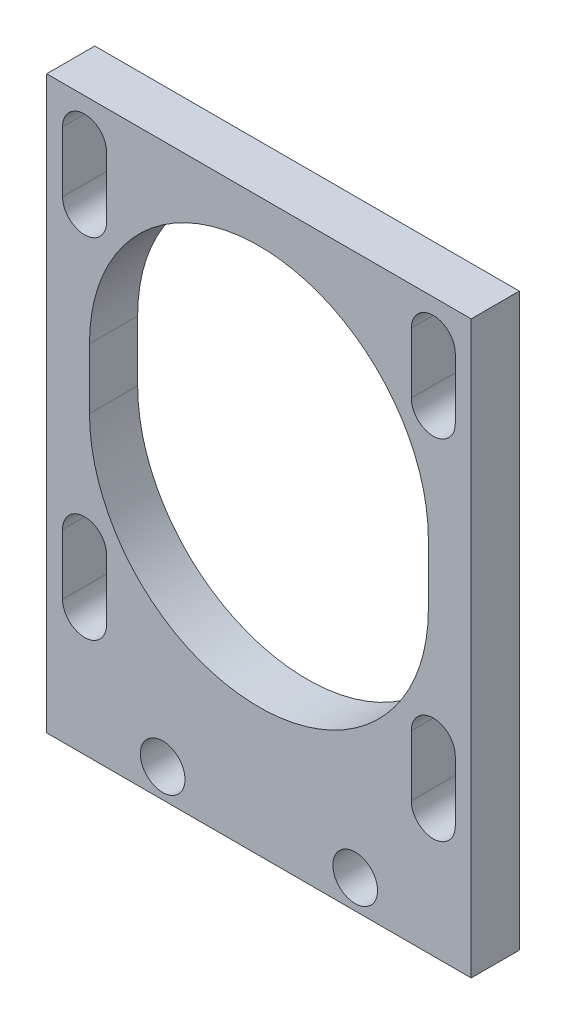
ISO-10303-21;
HEADER;
FILE_DESCRIPTION(('STEP AP214'),'2;1');
FILE_NAME('part.step','',(''),(''),'','','');
FILE_SCHEMA(('AUTOMOTIVE_DESIGN { 1 0 10303 214 1 1 1 1 }'));
ENDSEC;
DATA;
#1=APPLICATION_CONTEXT('core data for automotive mechanical design processes');
#2=APPLICATION_PROTOCOL_DEFINITION('international standard','automotive_design',2000,#1);
#3=PRODUCT_CONTEXT('',#1,'mechanical');
#4=PRODUCT('Part','Part','',(#3));
#5=PRODUCT_RELATED_PRODUCT_CATEGORY('part','',(#4));
#6=PRODUCT_DEFINITION_FORMATION('','',#4);
#7=PRODUCT_DEFINITION_CONTEXT('part definition',#1,'design');
#8=PRODUCT_DEFINITION('design','',#6,#7);
#9=PRODUCT_DEFINITION_SHAPE('','',#8);
#10=(LENGTH_UNIT() NAMED_UNIT(*) SI_UNIT(.MILLI.,.METRE.));
#11=(NAMED_UNIT(*) PLANE_ANGLE_UNIT() SI_UNIT($,.RADIAN.));
#12=(NAMED_UNIT(*) SI_UNIT($,.STERADIAN.) SOLID_ANGLE_UNIT());
#13=UNCERTAINTY_MEASURE_WITH_UNIT(LENGTH_MEASURE(1.E-05),#10,'distance_accuracy_value','');
#14=(GEOMETRIC_REPRESENTATION_CONTEXT(3) GLOBAL_UNCERTAINTY_ASSIGNED_CONTEXT((#13)) GLOBAL_UNIT_ASSIGNED_CONTEXT((#10,
#11,#12)) REPRESENTATION_CONTEXT('',''));
#15=CARTESIAN_POINT('',(0.,0.,0.));
#16=DIRECTION('',(0.,0.,1.));
#17=DIRECTION('',(1.,0.,0.));
#18=AXIS2_PLACEMENT_3D('',#15,#16,#17);
#19=CARTESIAN_POINT('',(13.99999994,-14.,3.175));
#20=DIRECTION('',(-1.,0.,0.));
#21=DIRECTION('',(0.,0.,1.));
#22=AXIS2_PLACEMENT_3D('',#19,#20,#21);
#23=PLANE('',#22);
#24=DIRECTION('',(0.,1.,0.));
#25=VECTOR('',#24,1.);
#26=CARTESIAN_POINT('',(13.99999994,-14.,3.175));
#27=LINE('',#26,#25);
#28=CARTESIAN_POINT('',(13.99999994,14.448,3.175));
#29=VERTEX_POINT('',#28);
#30=CARTESIAN_POINT('',(13.99999994,52.1,3.175));
#31=VERTEX_POINT('',#30);
#32=EDGE_CURVE('E40',#29,#31,#27,.T.);
#33=ORIENTED_EDGE('',*,*,#32,.F.);
#34=DIRECTION('',(0.,0.,-1.));
#35=VECTOR('',#34,1.);
#36=CARTESIAN_POINT('',(13.99999994,14.448,3.175));
#37=LINE('',#36,#35);
#38=CARTESIAN_POINT('',(13.99999994,14.448,0.));
#39=VERTEX_POINT('',#38);
#40=EDGE_CURVE('E195',#29,#39,#37,.T.);
#41=ORIENTED_EDGE('',*,*,#40,.T.);
#42=DIRECTION('',(0.,1.,0.));
#43=VECTOR('',#42,1.);
#44=CARTESIAN_POINT('',(13.99999994,-14.,0.));
#45=LINE('',#44,#43);
#46=CARTESIAN_POINT('',(13.99999994,52.1,0.));
#47=VERTEX_POINT('',#46);
#48=EDGE_CURVE('E230',#39,#47,#45,.T.);
#49=ORIENTED_EDGE('',*,*,#48,.T.);
#50=DIRECTION('',(0.,0.,-1.));
#51=VECTOR('',#50,1.);
#52=CARTESIAN_POINT('',(13.99999994,52.1,0.));
#53=LINE('',#52,#51);
#54=EDGE_CURVE('E213',#31,#47,#53,.T.);
#55=ORIENTED_EDGE('',*,*,#54,.F.);
#56=EDGE_LOOP('',(#33,#41,#49,#55));
#57=FACE_BOUND('',#56,.T.);
#58=ADVANCED_FACE('F32',(#57),#23,.F.);
#59=CARTESIAN_POINT('',(-13.99999994,-14.,3.175));
#60=DIRECTION('',(1.,0.,0.));
#61=DIRECTION('',(0.,0.,-1.));
#62=AXIS2_PLACEMENT_3D('',#59,#60,#61);
#63=PLANE('',#62);
#64=DIRECTION('',(0.,-1.,0.));
#65=VECTOR('',#64,1.);
#66=CARTESIAN_POINT('',(-13.99999994,-14.,0.));
#67=LINE('',#66,#65);
#68=CARTESIAN_POINT('',(-13.99999994,52.1,0.));
#69=VERTEX_POINT('',#68);
#70=CARTESIAN_POINT('',(-13.99999994,14.448,0.));
#71=VERTEX_POINT('',#70);
#72=EDGE_CURVE('E35',#69,#71,#67,.T.);
#73=ORIENTED_EDGE('',*,*,#72,.T.);
#74=DIRECTION('',(0.,0.,-1.));
#75=VECTOR('',#74,1.);
#76=CARTESIAN_POINT('',(-13.99999994,14.448,3.175));
#77=LINE('',#76,#75);
#78=CARTESIAN_POINT('',(-13.99999994,14.448,3.175));
#79=VERTEX_POINT('',#78);
#80=EDGE_CURVE('E48',#79,#71,#77,.T.);
#81=ORIENTED_EDGE('',*,*,#80,.F.);
#82=DIRECTION('',(0.,-1.,0.));
#83=VECTOR('',#82,1.);
#84=CARTESIAN_POINT('',(-13.99999994,-14.,3.175));
#85=LINE('',#84,#83);
#86=CARTESIAN_POINT('',(-13.99999994,52.1,3.175));
#87=VERTEX_POINT('',#86);
#88=EDGE_CURVE('E11',#87,#79,#85,.T.);
#89=ORIENTED_EDGE('',*,*,#88,.F.);
#90=DIRECTION('',(0.,0.,1.));
#91=VECTOR('',#90,1.);
#92=CARTESIAN_POINT('',(-13.99999994,52.1,0.));
#93=LINE('',#92,#91);
#94=EDGE_CURVE('E214',#69,#87,#93,.T.);
#95=ORIENTED_EDGE('',*,*,#94,.F.);
#96=EDGE_LOOP('',(#73,#81,#89,#95));
#97=FACE_BOUND('',#96,.T.);
#98=ADVANCED_FACE('F202',(#97),#63,.F.);
#99=CARTESIAN_POINT('',(13.99999994,14.,3.175));
#100=DIRECTION('',(0.,0.,-1.));
#101=DIRECTION('',(-1.,0.,0.));
#102=AXIS2_PLACEMENT_3D('',#99,#100,#101);
#103=PLANE('',#102);
#104=CARTESIAN_POINT('',(6.34999999999997,16.3457722435057,3.175));
#105=DIRECTION('',(0.,0.,-1.));
#106=DIRECTION('',(-1.,0.,0.));
#107=AXIS2_PLACEMENT_3D('',#104,#105,#106);
#108=CIRCLE('',#107,1.4732);
#109=CARTESIAN_POINT('',(4.87679999999998,16.3457722435057,3.175));
#110=VERTEX_POINT('',#109);
#111=EDGE_CURVE('E242',#110,#110,#108,.T.);
#112=ORIENTED_EDGE('',*,*,#111,.T.);
#113=EDGE_LOOP('',(#112));
#114=FACE_BOUND('',#113,.T.);
#115=CARTESIAN_POINT('',(-6.34999999999993,16.3457722435058,3.175));
#116=DIRECTION('',(0.,0.,-1.));
#117=DIRECTION('',(-1.,0.,0.));
#118=AXIS2_PLACEMENT_3D('',#115,#116,#117);
#119=CIRCLE('',#118,1.4732);
#120=CARTESIAN_POINT('',(-7.82319999999993,16.3457722435058,3.175));
#121=VERTEX_POINT('',#120);
#122=EDGE_CURVE('E248',#121,#121,#119,.T.);
#123=ORIENTED_EDGE('',*,*,#122,.T.);
#124=EDGE_LOOP('',(#123));
#125=FACE_BOUND('',#124,.T.);
#126=DIRECTION('',(0.,-1.,0.));
#127=VECTOR('',#126,1.);
#128=CARTESIAN_POINT('',(11.176,34.1,3.175));
#129=LINE('',#128,#127);
#130=CARTESIAN_POINT('',(11.176,38.1,3.175));
#131=VERTEX_POINT('',#130);
#132=CARTESIAN_POINT('',(11.176,34.1,3.175));
#133=VERTEX_POINT('',#132);
#134=EDGE_CURVE('E260',#131,#133,#129,.T.);
#135=ORIENTED_EDGE('',*,*,#134,.T.);
#136=CARTESIAN_POINT('',(0.,34.1,3.175));
#137=DIRECTION('',(0.,0.,-1.));
#138=DIRECTION('',(-1.,0.,0.));
#139=AXIS2_PLACEMENT_3D('',#136,#137,#138);
#140=CIRCLE('',#139,11.176);
#141=CARTESIAN_POINT('',(-11.176,34.1,3.175));
#142=VERTEX_POINT('',#141);
#143=EDGE_CURVE('E252',#133,#142,#140,.T.);
#144=ORIENTED_EDGE('',*,*,#143,.T.);
#145=DIRECTION('',(0.,1.,0.));
#146=VECTOR('',#145,1.);
#147=CARTESIAN_POINT('',(-11.176,34.1,3.175));
#148=LINE('',#147,#146);
#149=CARTESIAN_POINT('',(-11.176,38.1,3.175));
#150=VERTEX_POINT('',#149);
#151=EDGE_CURVE('E255',#142,#150,#148,.T.);
#152=ORIENTED_EDGE('',*,*,#151,.T.);
#153=CARTESIAN_POINT('',(0.,38.1,3.175));
#154=DIRECTION('',(0.,0.,-1.));
#155=DIRECTION('',(-1.,0.,0.));
#156=AXIS2_PLACEMENT_3D('',#153,#154,#155);
#157=CIRCLE('',#156,11.176);
#158=EDGE_CURVE('E56',#150,#131,#157,.T.);
#159=ORIENTED_EDGE('',*,*,#158,.T.);
#160=EDGE_LOOP('',(#135,#144,#152,#159));
#161=FACE_BOUND('',#160,.T.);
#162=DIRECTION('',(0.,-1.,0.));
#163=VECTOR('',#162,1.);
#164=CARTESIAN_POINT('',(-10.05000006,22.6,3.175));
#165=LINE('',#164,#163);
#166=CARTESIAN_POINT('',(-10.05000006,26.6,3.175));
#167=VERTEX_POINT('',#166);
#168=CARTESIAN_POINT('',(-10.05000006,22.6,3.175));
#169=VERTEX_POINT('',#168);
#170=EDGE_CURVE('E292',#167,#169,#165,.T.);
#171=ORIENTED_EDGE('',*,*,#170,.T.);
#172=CARTESIAN_POINT('',(-11.50000006,22.6,3.175));
#173=DIRECTION('',(0.,0.,-1.));
#174=DIRECTION('',(-1.,0.,0.));
#175=AXIS2_PLACEMENT_3D('',#172,#173,#174);
#176=CIRCLE('',#175,1.45);
#177=CARTESIAN_POINT('',(-12.95000006,22.6,3.175));
#178=VERTEX_POINT('',#177);
#179=EDGE_CURVE('E282',#169,#178,#176,.T.);
#180=ORIENTED_EDGE('',*,*,#179,.T.);
#181=DIRECTION('',(0.,1.,0.));
#182=VECTOR('',#181,1.);
#183=CARTESIAN_POINT('',(-12.95000006,22.6,3.175));
#184=LINE('',#183,#182);
#185=CARTESIAN_POINT('',(-12.95000006,26.6,3.175));
#186=VERTEX_POINT('',#185);
#187=EDGE_CURVE('E285',#178,#186,#184,.T.);
#188=ORIENTED_EDGE('',*,*,#187,.T.);
#189=CARTESIAN_POINT('',(-11.5000000600002,26.6,3.175));
#190=DIRECTION('',(0.,0.,-1.));
#191=DIRECTION('',(-1.,0.,0.));
#192=AXIS2_PLACEMENT_3D('',#189,#190,#191);
#193=CIRCLE('',#192,1.45);
#194=EDGE_CURVE('E289',#186,#167,#193,.T.);
#195=ORIENTED_EDGE('',*,*,#194,.T.);
#196=EDGE_LOOP('',(#171,#180,#188,#195));
#197=FACE_BOUND('',#196,.T.);
#198=DIRECTION('',(0.,-1.,0.));
#199=VECTOR('',#198,1.);
#200=CARTESIAN_POINT('',(12.94999994,22.6,3.175));
#201=LINE('',#200,#199);
#202=CARTESIAN_POINT('',(12.94999994,26.6,3.175));
#203=VERTEX_POINT('',#202);
#204=CARTESIAN_POINT('',(12.94999994,22.6,3.175));
#205=VERTEX_POINT('',#204);
#206=EDGE_CURVE('E324',#203,#205,#201,.T.);
#207=ORIENTED_EDGE('',*,*,#206,.T.);
#208=CARTESIAN_POINT('',(11.49999994,22.6,3.175));
#209=DIRECTION('',(0.,0.,-1.));
#210=DIRECTION('',(-1.,0.,0.));
#211=AXIS2_PLACEMENT_3D('',#208,#209,#210);
#212=CIRCLE('',#211,1.45);
#213=CARTESIAN_POINT('',(10.04999994,22.6,3.175));
#214=VERTEX_POINT('',#213);
#215=EDGE_CURVE('E314',#205,#214,#212,.T.);
#216=ORIENTED_EDGE('',*,*,#215,.T.);
#217=DIRECTION('',(0.,1.,0.));
#218=VECTOR('',#217,1.);
#219=CARTESIAN_POINT('',(10.04999994,22.6,3.175));
#220=LINE('',#219,#218);
#221=CARTESIAN_POINT('',(10.04999994,26.6,3.175));
#222=VERTEX_POINT('',#221);
#223=EDGE_CURVE('E317',#214,#222,#220,.T.);
#224=ORIENTED_EDGE('',*,*,#223,.T.);
#225=CARTESIAN_POINT('',(11.4999999399998,26.6,3.175));
#226=DIRECTION('',(0.,0.,-1.));
#227=DIRECTION('',(-1.,0.,0.));
#228=AXIS2_PLACEMENT_3D('',#225,#226,#227);
#229=CIRCLE('',#228,1.45);
#230=EDGE_CURVE('E321',#222,#203,#229,.T.);
#231=ORIENTED_EDGE('',*,*,#230,.T.);
#232=EDGE_LOOP('',(#207,#216,#224,#231));
#233=FACE_BOUND('',#232,.T.);
#234=DIRECTION('',(0.,-1.,0.));
#235=VECTOR('',#234,1.);
#236=CARTESIAN_POINT('',(-10.05000006,45.6,3.175));
#237=LINE('',#236,#235);
#238=CARTESIAN_POINT('',(-10.05000006,49.6,3.175));
#239=VERTEX_POINT('',#238);
#240=CARTESIAN_POINT('',(-10.05000006,45.6,3.175));
#241=VERTEX_POINT('',#240);
#242=EDGE_CURVE('E356',#239,#241,#237,.T.);
#243=ORIENTED_EDGE('',*,*,#242,.T.);
#244=CARTESIAN_POINT('',(-11.5000000599998,45.6,3.175));
#245=DIRECTION('',(0.,0.,-1.));
#246=DIRECTION('',(-1.,0.,0.));
#247=AXIS2_PLACEMENT_3D('',#244,#245,#246);
#248=CIRCLE('',#247,1.45);
#249=CARTESIAN_POINT('',(-12.95000006,45.6,3.175));
#250=VERTEX_POINT('',#249);
#251=EDGE_CURVE('E346',#241,#250,#248,.T.);
#252=ORIENTED_EDGE('',*,*,#251,.T.);
#253=DIRECTION('',(0.,1.,0.));
#254=VECTOR('',#253,1.);
#255=CARTESIAN_POINT('',(-12.95000006,45.6,3.175));
#256=LINE('',#255,#254);
#257=CARTESIAN_POINT('',(-12.95000006,49.6,3.175));
#258=VERTEX_POINT('',#257);
#259=EDGE_CURVE('E349',#250,#258,#256,.T.);
#260=ORIENTED_EDGE('',*,*,#259,.T.);
#261=CARTESIAN_POINT('',(-11.50000006,49.6,3.175));
#262=DIRECTION('',(0.,0.,-1.));
#263=DIRECTION('',(-1.,0.,0.));
#264=AXIS2_PLACEMENT_3D('',#261,#262,#263);
#265=CIRCLE('',#264,1.45);
#266=EDGE_CURVE('E353',#258,#239,#265,.T.);
#267=ORIENTED_EDGE('',*,*,#266,.T.);
#268=EDGE_LOOP('',(#243,#252,#260,#267));
#269=FACE_BOUND('',#268,.T.);
#270=DIRECTION('',(0.,-1.,0.));
#271=VECTOR('',#270,1.);
#272=CARTESIAN_POINT('',(12.94999994,45.6,3.175));
#273=LINE('',#272,#271);
#274=CARTESIAN_POINT('',(12.94999994,49.6,3.175));
#275=VERTEX_POINT('',#274);
#276=CARTESIAN_POINT('',(12.94999994,45.6,3.175));
#277=VERTEX_POINT('',#276);
#278=EDGE_CURVE('E388',#275,#277,#273,.T.);
#279=ORIENTED_EDGE('',*,*,#278,.T.);
#280=CARTESIAN_POINT('',(11.49999994,45.6,3.175));
#281=DIRECTION('',(0.,0.,-1.));
#282=DIRECTION('',(-1.,0.,0.));
#283=AXIS2_PLACEMENT_3D('',#280,#281,#282);
#284=CIRCLE('',#283,1.45);
#285=CARTESIAN_POINT('',(10.04999994,45.6,3.175));
#286=VERTEX_POINT('',#285);
#287=EDGE_CURVE('E378',#277,#286,#284,.T.);
#288=ORIENTED_EDGE('',*,*,#287,.T.);
#289=DIRECTION('',(0.,1.,0.));
#290=VECTOR('',#289,1.);
#291=CARTESIAN_POINT('',(10.04999994,45.6,3.175));
#292=LINE('',#291,#290);
#293=CARTESIAN_POINT('',(10.04999994,49.6,3.175));
#294=VERTEX_POINT('',#293);
#295=EDGE_CURVE('E381',#286,#294,#292,.T.);
#296=ORIENTED_EDGE('',*,*,#295,.T.);
#297=CARTESIAN_POINT('',(11.49999994,49.6,3.175));
#298=DIRECTION('',(0.,0.,-1.));
#299=DIRECTION('',(-1.,0.,0.));
#300=AXIS2_PLACEMENT_3D('',#297,#298,#299);
#301=CIRCLE('',#300,1.45);
#302=EDGE_CURVE('E385',#294,#275,#301,.T.);
#303=ORIENTED_EDGE('',*,*,#302,.T.);
#304=EDGE_LOOP('',(#279,#288,#296,#303));
#305=FACE_BOUND('',#304,.T.);
#306=ORIENTED_EDGE('',*,*,#88,.T.);
#307=DIRECTION('',(1.,0.,0.));
#308=VECTOR('',#307,1.);
#309=CARTESIAN_POINT('',(13.99999994,14.448,3.175));
#310=LINE('',#309,#308);
#311=EDGE_CURVE('E192',#79,#29,#310,.T.);
#312=ORIENTED_EDGE('',*,*,#311,.T.);
#313=ORIENTED_EDGE('',*,*,#32,.T.);
#314=DIRECTION('',(1.,0.,0.));
#315=VECTOR('',#314,1.);
#316=CARTESIAN_POINT('',(-13.99999994,52.1,3.175));
#317=LINE('',#316,#315);
#318=EDGE_CURVE('E208',#87,#31,#317,.T.);
#319=ORIENTED_EDGE('',*,*,#318,.F.);
#320=EDGE_LOOP('',(#306,#312,#313,#319));
#321=FACE_BOUND('',#320,.T.);
#322=ADVANCED_FACE('F206',(#114,#125,#161,#197,#233,#269,#305,#321),#103,.F.);
#323=CARTESIAN_POINT('',(13.99999994,14.,0.));
#324=DIRECTION('',(0.,0.,-1.));
#325=DIRECTION('',(-1.,0.,0.));
#326=AXIS2_PLACEMENT_3D('',#323,#324,#325);
#327=PLANE('',#326);
#328=DIRECTION('',(1.,0.,0.));
#329=VECTOR('',#328,1.);
#330=CARTESIAN_POINT('',(13.99999994,14.448,0.));
#331=LINE('',#330,#329);
#332=EDGE_CURVE('E198',#71,#39,#331,.T.);
#333=ORIENTED_EDGE('',*,*,#332,.F.);
#334=ORIENTED_EDGE('',*,*,#72,.F.);
#335=DIRECTION('',(-1.,0.,0.));
#336=VECTOR('',#335,1.);
#337=CARTESIAN_POINT('',(-13.99999994,52.1,0.));
#338=LINE('',#337,#336);
#339=EDGE_CURVE('E219',#47,#69,#338,.T.);
#340=ORIENTED_EDGE('',*,*,#339,.F.);
#341=ORIENTED_EDGE('',*,*,#48,.F.);
#342=EDGE_LOOP('',(#333,#334,#340,#341));
#343=FACE_BOUND('',#342,.T.);
#344=CARTESIAN_POINT('',(6.34999999999997,16.3457722435057,0.));
#345=DIRECTION('',(0.,0.,-1.));
#346=DIRECTION('',(-1.,0.,0.));
#347=AXIS2_PLACEMENT_3D('',#344,#345,#346);
#348=CIRCLE('',#347,1.4732);
#349=CARTESIAN_POINT('',(4.87679999999998,16.3457722435057,0.));
#350=VERTEX_POINT('',#349);
#351=EDGE_CURVE('E238',#350,#350,#348,.T.);
#352=ORIENTED_EDGE('',*,*,#351,.F.);
#353=EDGE_LOOP('',(#352));
#354=FACE_BOUND('',#353,.T.);
#355=CARTESIAN_POINT('',(-6.34999999999993,16.3457722435058,0.));
#356=DIRECTION('',(0.,0.,-1.));
#357=DIRECTION('',(-1.,0.,0.));
#358=AXIS2_PLACEMENT_3D('',#355,#356,#357);
#359=CIRCLE('',#358,1.4732);
#360=CARTESIAN_POINT('',(-7.82319999999993,16.3457722435058,0.));
#361=VERTEX_POINT('',#360);
#362=EDGE_CURVE('E245',#361,#361,#359,.T.);
#363=ORIENTED_EDGE('',*,*,#362,.F.);
#364=EDGE_LOOP('',(#363));
#365=FACE_BOUND('',#364,.T.);
#366=CARTESIAN_POINT('',(0.,34.1,0.));
#367=DIRECTION('',(0.,0.,-1.));
#368=DIRECTION('',(-1.,0.,0.));
#369=AXIS2_PLACEMENT_3D('',#366,#367,#368);
#370=CIRCLE('',#369,11.176);
#371=CARTESIAN_POINT('',(11.176,34.1,0.));
#372=VERTEX_POINT('',#371);
#373=CARTESIAN_POINT('',(-11.176,34.1,0.));
#374=VERTEX_POINT('',#373);
#375=EDGE_CURVE('E251',#372,#374,#370,.T.);
#376=ORIENTED_EDGE('',*,*,#375,.F.);
#377=DIRECTION('',(0.,-1.,0.));
#378=VECTOR('',#377,1.);
#379=CARTESIAN_POINT('',(11.176,34.1,0.));
#380=LINE('',#379,#378);
#381=CARTESIAN_POINT('',(11.176,38.1,0.));
#382=VERTEX_POINT('',#381);
#383=EDGE_CURVE('E256',#382,#372,#380,.T.);
#384=ORIENTED_EDGE('',*,*,#383,.F.);
#385=CARTESIAN_POINT('',(0.,38.1,0.));
#386=DIRECTION('',(0.,0.,-1.));
#387=DIRECTION('',(-1.,0.,0.));
#388=AXIS2_PLACEMENT_3D('',#385,#386,#387);
#389=CIRCLE('',#388,11.176);
#390=CARTESIAN_POINT('',(-11.176,38.1,0.));
#391=VERTEX_POINT('',#390);
#392=EDGE_CURVE('E268',#391,#382,#389,.T.);
#393=ORIENTED_EDGE('',*,*,#392,.F.);
#394=DIRECTION('',(0.,1.,0.));
#395=VECTOR('',#394,1.);
#396=CARTESIAN_POINT('',(-11.176,34.1,0.));
#397=LINE('',#396,#395);
#398=EDGE_CURVE('E265',#374,#391,#397,.T.);
#399=ORIENTED_EDGE('',*,*,#398,.F.);
#400=EDGE_LOOP('',(#376,#384,#393,#399));
#401=FACE_BOUND('',#400,.T.);
#402=CARTESIAN_POINT('',(-11.50000006,22.6,0.));
#403=DIRECTION('',(0.,0.,-1.));
#404=DIRECTION('',(-1.,0.,0.));
#405=AXIS2_PLACEMENT_3D('',#402,#403,#404);
#406=CIRCLE('',#405,1.45);
#407=CARTESIAN_POINT('',(-10.05000006,22.6,0.));
#408=VERTEX_POINT('',#407);
#409=CARTESIAN_POINT('',(-12.95000006,22.6,0.));
#410=VERTEX_POINT('',#409);
#411=EDGE_CURVE('E275',#408,#410,#406,.T.);
#412=ORIENTED_EDGE('',*,*,#411,.F.);
#413=DIRECTION('',(0.,-1.,0.));
#414=VECTOR('',#413,1.);
#415=CARTESIAN_POINT('',(-10.05000006,22.6,0.));
#416=LINE('',#415,#414);
#417=CARTESIAN_POINT('',(-10.05000006,26.6,0.));
#418=VERTEX_POINT('',#417);
#419=EDGE_CURVE('E286',#418,#408,#416,.T.);
#420=ORIENTED_EDGE('',*,*,#419,.F.);
#421=CARTESIAN_POINT('',(-11.5000000600002,26.6,0.));
#422=DIRECTION('',(0.,0.,-1.));
#423=DIRECTION('',(-1.,0.,0.));
#424=AXIS2_PLACEMENT_3D('',#421,#422,#423);
#425=CIRCLE('',#424,1.45);
#426=CARTESIAN_POINT('',(-12.9500000600002,26.6,0.));
#427=VERTEX_POINT('',#426);
#428=EDGE_CURVE('E300',#427,#418,#425,.T.);
#429=ORIENTED_EDGE('',*,*,#428,.F.);
#430=DIRECTION('',(0.,1.,0.));
#431=VECTOR('',#430,1.);
#432=CARTESIAN_POINT('',(-12.95000006,22.6,0.));
#433=LINE('',#432,#431);
#434=EDGE_CURVE('E297',#410,#427,#433,.T.);
#435=ORIENTED_EDGE('',*,*,#434,.F.);
#436=EDGE_LOOP('',(#412,#420,#429,#435));
#437=FACE_BOUND('',#436,.T.);
#438=CARTESIAN_POINT('',(11.49999994,22.6,0.));
#439=DIRECTION('',(0.,0.,-1.));
#440=DIRECTION('',(-1.,0.,0.));
#441=AXIS2_PLACEMENT_3D('',#438,#439,#440);
#442=CIRCLE('',#441,1.45);
#443=CARTESIAN_POINT('',(12.94999994,22.6,0.));
#444=VERTEX_POINT('',#443);
#445=CARTESIAN_POINT('',(10.04999994,22.6,0.));
#446=VERTEX_POINT('',#445);
#447=EDGE_CURVE('E307',#444,#446,#442,.T.);
#448=ORIENTED_EDGE('',*,*,#447,.F.);
#449=DIRECTION('',(0.,-1.,0.));
#450=VECTOR('',#449,1.);
#451=CARTESIAN_POINT('',(12.94999994,22.6,0.));
#452=LINE('',#451,#450);
#453=CARTESIAN_POINT('',(12.94999994,26.6,0.));
#454=VERTEX_POINT('',#453);
#455=EDGE_CURVE('E318',#454,#444,#452,.T.);
#456=ORIENTED_EDGE('',*,*,#455,.F.);
#457=CARTESIAN_POINT('',(11.4999999399998,26.6,0.));
#458=DIRECTION('',(0.,0.,-1.));
#459=DIRECTION('',(-1.,0.,0.));
#460=AXIS2_PLACEMENT_3D('',#457,#458,#459);
#461=CIRCLE('',#460,1.45);
#462=CARTESIAN_POINT('',(10.0499999399998,26.6,0.));
#463=VERTEX_POINT('',#462);
#464=EDGE_CURVE('E332',#463,#454,#461,.T.);
#465=ORIENTED_EDGE('',*,*,#464,.F.);
#466=DIRECTION('',(0.,1.,0.));
#467=VECTOR('',#466,1.);
#468=CARTESIAN_POINT('',(10.04999994,22.6,0.));
#469=LINE('',#468,#467);
#470=EDGE_CURVE('E329',#446,#463,#469,.T.);
#471=ORIENTED_EDGE('',*,*,#470,.F.);
#472=EDGE_LOOP('',(#448,#456,#465,#471));
#473=FACE_BOUND('',#472,.T.);
#474=CARTESIAN_POINT('',(-11.5000000599998,45.6,0.));
#475=DIRECTION('',(0.,0.,-1.));
#476=DIRECTION('',(-1.,0.,0.));
#477=AXIS2_PLACEMENT_3D('',#474,#475,#476);
#478=CIRCLE('',#477,1.45);
#479=CARTESIAN_POINT('',(-10.05000006,45.6,0.));
#480=VERTEX_POINT('',#479);
#481=CARTESIAN_POINT('',(-12.95000006,45.6,0.));
#482=VERTEX_POINT('',#481);
#483=EDGE_CURVE('E339',#480,#482,#478,.T.);
#484=ORIENTED_EDGE('',*,*,#483,.F.);
#485=DIRECTION('',(0.,-1.,0.));
#486=VECTOR('',#485,1.);
#487=CARTESIAN_POINT('',(-10.05000006,45.6,0.));
#488=LINE('',#487,#486);
#489=CARTESIAN_POINT('',(-10.05000006,49.6,0.));
#490=VERTEX_POINT('',#489);
#491=EDGE_CURVE('E350',#490,#480,#488,.T.);
#492=ORIENTED_EDGE('',*,*,#491,.F.);
#493=CARTESIAN_POINT('',(-11.50000006,49.6,0.));
#494=DIRECTION('',(0.,0.,-1.));
#495=DIRECTION('',(-1.,0.,0.));
#496=AXIS2_PLACEMENT_3D('',#493,#494,#495);
#497=CIRCLE('',#496,1.45);
#498=CARTESIAN_POINT('',(-12.95000006,49.6,0.));
#499=VERTEX_POINT('',#498);
#500=EDGE_CURVE('E364',#499,#490,#497,.T.);
#501=ORIENTED_EDGE('',*,*,#500,.F.);
#502=DIRECTION('',(0.,1.,0.));
#503=VECTOR('',#502,1.);
#504=CARTESIAN_POINT('',(-12.95000006,45.6,0.));
#505=LINE('',#504,#503);
#506=EDGE_CURVE('E361',#482,#499,#505,.T.);
#507=ORIENTED_EDGE('',*,*,#506,.F.);
#508=EDGE_LOOP('',(#484,#492,#501,#507));
#509=FACE_BOUND('',#508,.T.);
#510=CARTESIAN_POINT('',(11.49999994,45.6,0.));
#511=DIRECTION('',(0.,0.,-1.));
#512=DIRECTION('',(-1.,0.,0.));
#513=AXIS2_PLACEMENT_3D('',#510,#511,#512);
#514=CIRCLE('',#513,1.45);
#515=CARTESIAN_POINT('',(12.94999994,45.6,0.));
#516=VERTEX_POINT('',#515);
#517=CARTESIAN_POINT('',(10.04999994,45.6,0.));
#518=VERTEX_POINT('',#517);
#519=EDGE_CURVE('E371',#516,#518,#514,.T.);
#520=ORIENTED_EDGE('',*,*,#519,.F.);
#521=DIRECTION('',(0.,-1.,0.));
#522=VECTOR('',#521,1.);
#523=CARTESIAN_POINT('',(12.94999994,45.6,0.));
#524=LINE('',#523,#522);
#525=CARTESIAN_POINT('',(12.94999994,49.6,0.));
#526=VERTEX_POINT('',#525);
#527=EDGE_CURVE('E382',#526,#516,#524,.T.);
#528=ORIENTED_EDGE('',*,*,#527,.F.);
#529=CARTESIAN_POINT('',(11.49999994,49.6,0.));
#530=DIRECTION('',(0.,0.,-1.));
#531=DIRECTION('',(-1.,0.,0.));
#532=AXIS2_PLACEMENT_3D('',#529,#530,#531);
#533=CIRCLE('',#532,1.45);
#534=CARTESIAN_POINT('',(10.04999994,49.6,0.));
#535=VERTEX_POINT('',#534);
#536=EDGE_CURVE('E395',#535,#526,#533,.T.);
#537=ORIENTED_EDGE('',*,*,#536,.F.);
#538=DIRECTION('',(0.,1.,0.));
#539=VECTOR('',#538,1.);
#540=CARTESIAN_POINT('',(10.04999994,45.6,0.));
#541=LINE('',#540,#539);
#542=EDGE_CURVE('E392',#518,#535,#541,.T.);
#543=ORIENTED_EDGE('',*,*,#542,.F.);
#544=EDGE_LOOP('',(#520,#528,#537,#543));
#545=FACE_BOUND('',#544,.T.);
#546=ADVANCED_FACE('F234',(#343,#354,#365,#401,#437,#473,#509,#545),#327,.T.);
#547=CARTESIAN_POINT('',(-13.99999994,52.1,3.175));
#548=DIRECTION('',(0.,1.,0.));
#549=DIRECTION('',(0.,0.,1.));
#550=AXIS2_PLACEMENT_3D('',#547,#548,#549);
#551=PLANE('',#550);
#552=ORIENTED_EDGE('',*,*,#94,.T.);
#553=ORIENTED_EDGE('',*,*,#318,.T.);
#554=ORIENTED_EDGE('',*,*,#54,.T.);
#555=ORIENTED_EDGE('',*,*,#339,.T.);
#556=EDGE_LOOP('',(#552,#553,#554,#555));
#557=FACE_BOUND('',#556,.T.);
#558=ADVANCED_FACE('F217',(#557),#551,.T.);
#559=CARTESIAN_POINT('',(11.49999994,45.6,3.175));
#560=DIRECTION('',(0.,0.,-1.));
#561=DIRECTION('',(-1.,0.,0.));
#562=AXIS2_PLACEMENT_3D('',#559,#560,#561);
#563=CYLINDRICAL_SURFACE('',#562,1.45);
#564=ORIENTED_EDGE('',*,*,#519,.T.);
#565=DIRECTION('',(0.,0.,-1.));
#566=VECTOR('',#565,1.);
#567=CARTESIAN_POINT('',(10.04999994,45.6,3.175));
#568=LINE('',#567,#566);
#569=EDGE_CURVE('E225',#286,#518,#568,.T.);
#570=ORIENTED_EDGE('',*,*,#569,.F.);
#571=ORIENTED_EDGE('',*,*,#287,.F.);
#572=DIRECTION('',(0.,0.,-1.));
#573=VECTOR('',#572,1.);
#574=CARTESIAN_POINT('',(12.94999994,45.6,3.175));
#575=LINE('',#574,#573);
#576=EDGE_CURVE('E220',#277,#516,#575,.T.);
#577=ORIENTED_EDGE('',*,*,#576,.T.);
#578=EDGE_LOOP('',(#564,#570,#571,#577));
#579=FACE_BOUND('',#578,.T.);
#580=ADVANCED_FACE('F419',(#579),#563,.F.);
#581=CARTESIAN_POINT('',(12.94999994,45.6,3.175));
#582=DIRECTION('',(1.,0.,0.));
#583=DIRECTION('',(0.,0.,-1.));
#584=AXIS2_PLACEMENT_3D('',#581,#582,#583);
#585=PLANE('',#584);
#586=ORIENTED_EDGE('',*,*,#527,.T.);
#587=ORIENTED_EDGE('',*,*,#576,.F.);
#588=ORIENTED_EDGE('',*,*,#278,.F.);
#589=DIRECTION('',(0.,0.,-1.));
#590=VECTOR('',#589,1.);
#591=CARTESIAN_POINT('',(12.94999994,49.6,3.175));
#592=LINE('',#591,#590);
#593=EDGE_CURVE('E222',#275,#526,#592,.T.);
#594=ORIENTED_EDGE('',*,*,#593,.T.);
#595=EDGE_LOOP('',(#586,#587,#588,#594));
#596=FACE_BOUND('',#595,.T.);
#597=ADVANCED_FACE('F417',(#596),#585,.F.);
#598=CARTESIAN_POINT('',(11.49999994,49.6,3.175));
#599=DIRECTION('',(0.,0.,-1.));
#600=DIRECTION('',(-1.,0.,0.));
#601=AXIS2_PLACEMENT_3D('',#598,#599,#600);
#602=CYLINDRICAL_SURFACE('',#601,1.45);
#603=ORIENTED_EDGE('',*,*,#536,.T.);
#604=ORIENTED_EDGE('',*,*,#593,.F.);
#605=ORIENTED_EDGE('',*,*,#302,.F.);
#606=DIRECTION('',(0.,0.,-1.));
#607=VECTOR('',#606,1.);
#608=CARTESIAN_POINT('',(10.04999994,49.6,3.175));
#609=LINE('',#608,#607);
#610=EDGE_CURVE('E400',#294,#535,#609,.T.);
#611=ORIENTED_EDGE('',*,*,#610,.T.);
#612=EDGE_LOOP('',(#603,#604,#605,#611));
#613=FACE_BOUND('',#612,.T.);
#614=ADVANCED_FACE('F414',(#613),#602,.F.);
#615=CARTESIAN_POINT('',(10.04999994,45.6,3.175));
#616=DIRECTION('',(-1.,0.,0.));
#617=DIRECTION('',(0.,0.,1.));
#618=AXIS2_PLACEMENT_3D('',#615,#616,#617);
#619=PLANE('',#618);
#620=ORIENTED_EDGE('',*,*,#542,.T.);
#621=ORIENTED_EDGE('',*,*,#610,.F.);
#622=ORIENTED_EDGE('',*,*,#295,.F.);
#623=ORIENTED_EDGE('',*,*,#569,.T.);
#624=EDGE_LOOP('',(#620,#621,#622,#623));
#625=FACE_BOUND('',#624,.T.);
#626=ADVANCED_FACE('F407',(#625),#619,.F.);
#627=CARTESIAN_POINT('',(-11.5000000599998,45.6,3.175));
#628=DIRECTION('',(0.,0.,-1.));
#629=DIRECTION('',(-1.,0.,0.));
#630=AXIS2_PLACEMENT_3D('',#627,#628,#629);
#631=CYLINDRICAL_SURFACE('',#630,1.45);
#632=ORIENTED_EDGE('',*,*,#483,.T.);
#633=DIRECTION('',(0.,0.,-1.));
#634=VECTOR('',#633,1.);
#635=CARTESIAN_POINT('',(-12.95000006,45.6,3.175));
#636=LINE('',#635,#634);
#637=EDGE_CURVE('E359',#250,#482,#636,.T.);
#638=ORIENTED_EDGE('',*,*,#637,.F.);
#639=ORIENTED_EDGE('',*,*,#251,.F.);
#640=DIRECTION('',(0.,0.,-1.));
#641=VECTOR('',#640,1.);
#642=CARTESIAN_POINT('',(-10.05000006,45.6,3.175));
#643=LINE('',#642,#641);
#644=EDGE_CURVE('E369',#241,#480,#643,.T.);
#645=ORIENTED_EDGE('',*,*,#644,.T.);
#646=EDGE_LOOP('',(#632,#638,#639,#645));
#647=FACE_BOUND('',#646,.T.);
#648=ADVANCED_FACE('F476',(#647),#631,.F.);
#649=CARTESIAN_POINT('',(-10.05000006,45.6,3.175));
#650=DIRECTION('',(1.,0.,0.));
#651=DIRECTION('',(0.,0.,-1.));
#652=AXIS2_PLACEMENT_3D('',#649,#650,#651);
#653=PLANE('',#652);
#654=ORIENTED_EDGE('',*,*,#491,.T.);
#655=ORIENTED_EDGE('',*,*,#644,.F.);
#656=ORIENTED_EDGE('',*,*,#242,.F.);
#657=DIRECTION('',(0.,0.,-1.));
#658=VECTOR('',#657,1.);
#659=CARTESIAN_POINT('',(-10.05000006,49.6,3.175));
#660=LINE('',#659,#658);
#661=EDGE_CURVE('E372',#239,#490,#660,.T.);
#662=ORIENTED_EDGE('',*,*,#661,.T.);
#663=EDGE_LOOP('',(#654,#655,#656,#662));
#664=FACE_BOUND('',#663,.T.);
#665=ADVANCED_FACE('F484',(#664),#653,.F.);
#666=CARTESIAN_POINT('',(-11.50000006,49.6,3.175));
#667=DIRECTION('',(0.,0.,-1.));
#668=DIRECTION('',(-1.,0.,0.));
#669=AXIS2_PLACEMENT_3D('',#666,#667,#668);
#670=CYLINDRICAL_SURFACE('',#669,1.45);
#671=ORIENTED_EDGE('',*,*,#500,.T.);
#672=ORIENTED_EDGE('',*,*,#661,.F.);
#673=ORIENTED_EDGE('',*,*,#266,.F.);
#674=DIRECTION('',(0.,0.,-1.));
#675=VECTOR('',#674,1.);
#676=CARTESIAN_POINT('',(-12.95000006,49.6,3.175));
#677=LINE('',#676,#675);
#678=EDGE_CURVE('E374',#258,#499,#677,.T.);
#679=ORIENTED_EDGE('',*,*,#678,.T.);
#680=EDGE_LOOP('',(#671,#672,#673,#679));
#681=FACE_BOUND('',#680,.T.);
#682=ADVANCED_FACE('F494',(#681),#670,.F.);
#683=CARTESIAN_POINT('',(-12.95000006,45.6,3.175));
#684=DIRECTION('',(-1.,0.,0.));
#685=DIRECTION('',(0.,0.,1.));
#686=AXIS2_PLACEMENT_3D('',#683,#684,#685);
#687=PLANE('',#686);
#688=ORIENTED_EDGE('',*,*,#506,.T.);
#689=ORIENTED_EDGE('',*,*,#678,.F.);
#690=ORIENTED_EDGE('',*,*,#259,.F.);
#691=ORIENTED_EDGE('',*,*,#637,.T.);
#692=EDGE_LOOP('',(#688,#689,#690,#691));
#693=FACE_BOUND('',#692,.T.);
#694=ADVANCED_FACE('F504',(#693),#687,.F.);
#695=CARTESIAN_POINT('',(11.49999994,22.6,3.175));
#696=DIRECTION('',(0.,0.,-1.));
#697=DIRECTION('',(-1.,0.,0.));
#698=AXIS2_PLACEMENT_3D('',#695,#696,#697);
#699=CYLINDRICAL_SURFACE('',#698,1.45);
#700=ORIENTED_EDGE('',*,*,#447,.T.);
#701=DIRECTION('',(0.,0.,-1.));
#702=VECTOR('',#701,1.);
#703=CARTESIAN_POINT('',(10.04999994,22.6,3.175));
#704=LINE('',#703,#702);
#705=EDGE_CURVE('E327',#214,#446,#704,.T.);
#706=ORIENTED_EDGE('',*,*,#705,.F.);
#707=ORIENTED_EDGE('',*,*,#215,.F.);
#708=DIRECTION('',(0.,0.,-1.));
#709=VECTOR('',#708,1.);
#710=CARTESIAN_POINT('',(12.94999994,22.6,3.175));
#711=LINE('',#710,#709);
#712=EDGE_CURVE('E337',#205,#444,#711,.T.);
#713=ORIENTED_EDGE('',*,*,#712,.T.);
#714=EDGE_LOOP('',(#700,#706,#707,#713));
#715=FACE_BOUND('',#714,.T.);
#716=ADVANCED_FACE('F514',(#715),#699,.F.);
#717=CARTESIAN_POINT('',(12.94999994,22.6,3.175));
#718=DIRECTION('',(1.,0.,0.));
#719=DIRECTION('',(0.,0.,-1.));
#720=AXIS2_PLACEMENT_3D('',#717,#718,#719);
#721=PLANE('',#720);
#722=ORIENTED_EDGE('',*,*,#455,.T.);
#723=ORIENTED_EDGE('',*,*,#712,.F.);
#724=ORIENTED_EDGE('',*,*,#206,.F.);
#725=DIRECTION('',(0.,0.,-1.));
#726=VECTOR('',#725,1.);
#727=CARTESIAN_POINT('',(12.94999994,26.6,3.175));
#728=LINE('',#727,#726);
#729=EDGE_CURVE('E340',#203,#454,#728,.T.);
#730=ORIENTED_EDGE('',*,*,#729,.T.);
#731=EDGE_LOOP('',(#722,#723,#724,#730));
#732=FACE_BOUND('',#731,.T.);
#733=ADVANCED_FACE('F524',(#732),#721,.F.);
#734=CARTESIAN_POINT('',(11.4999999399998,26.6,3.175));
#735=DIRECTION('',(0.,0.,-1.));
#736=DIRECTION('',(-1.,0.,0.));
#737=AXIS2_PLACEMENT_3D('',#734,#735,#736);
#738=CYLINDRICAL_SURFACE('',#737,1.45);
#739=ORIENTED_EDGE('',*,*,#464,.T.);
#740=ORIENTED_EDGE('',*,*,#729,.F.);
#741=ORIENTED_EDGE('',*,*,#230,.F.);
#742=DIRECTION('',(0.,0.,-1.));
#743=VECTOR('',#742,1.);
#744=CARTESIAN_POINT('',(10.0499999399998,26.6,3.175));
#745=LINE('',#744,#743);
#746=EDGE_CURVE('E342',#222,#463,#745,.T.);
#747=ORIENTED_EDGE('',*,*,#746,.T.);
#748=EDGE_LOOP('',(#739,#740,#741,#747));
#749=FACE_BOUND('',#748,.T.);
#750=ADVANCED_FACE('F534',(#749),#738,.F.);
#751=CARTESIAN_POINT('',(10.04999994,22.6,3.175));
#752=DIRECTION('',(-1.,0.,0.));
#753=DIRECTION('',(0.,0.,1.));
#754=AXIS2_PLACEMENT_3D('',#751,#752,#753);
#755=PLANE('',#754);
#756=ORIENTED_EDGE('',*,*,#470,.T.);
#757=ORIENTED_EDGE('',*,*,#746,.F.);
#758=ORIENTED_EDGE('',*,*,#223,.F.);
#759=ORIENTED_EDGE('',*,*,#705,.T.);
#760=EDGE_LOOP('',(#756,#757,#758,#759));
#761=FACE_BOUND('',#760,.T.);
#762=ADVANCED_FACE('F544',(#761),#755,.F.);
#763=CARTESIAN_POINT('',(-11.50000006,22.6,3.175));
#764=DIRECTION('',(0.,0.,-1.));
#765=DIRECTION('',(-1.,0.,0.));
#766=AXIS2_PLACEMENT_3D('',#763,#764,#765);
#767=CYLINDRICAL_SURFACE('',#766,1.45);
#768=ORIENTED_EDGE('',*,*,#411,.T.);
#769=DIRECTION('',(0.,0.,-1.));
#770=VECTOR('',#769,1.);
#771=CARTESIAN_POINT('',(-12.95000006,22.6,3.175));
#772=LINE('',#771,#770);
#773=EDGE_CURVE('E295',#178,#410,#772,.T.);
#774=ORIENTED_EDGE('',*,*,#773,.F.);
#775=ORIENTED_EDGE('',*,*,#179,.F.);
#776=DIRECTION('',(0.,0.,-1.));
#777=VECTOR('',#776,1.);
#778=CARTESIAN_POINT('',(-10.05000006,22.6,3.175));
#779=LINE('',#778,#777);
#780=EDGE_CURVE('E305',#169,#408,#779,.T.);
#781=ORIENTED_EDGE('',*,*,#780,.T.);
#782=EDGE_LOOP('',(#768,#774,#775,#781));
#783=FACE_BOUND('',#782,.T.);
#784=ADVANCED_FACE('F554',(#783),#767,.F.);
#785=CARTESIAN_POINT('',(-10.05000006,22.6,3.175));
#786=DIRECTION('',(1.,0.,0.));
#787=DIRECTION('',(0.,0.,-1.));
#788=AXIS2_PLACEMENT_3D('',#785,#786,#787);
#789=PLANE('',#788);
#790=ORIENTED_EDGE('',*,*,#419,.T.);
#791=ORIENTED_EDGE('',*,*,#780,.F.);
#792=ORIENTED_EDGE('',*,*,#170,.F.);
#793=DIRECTION('',(0.,0.,-1.));
#794=VECTOR('',#793,1.);
#795=CARTESIAN_POINT('',(-10.05000006,26.6,3.175));
#796=LINE('',#795,#794);
#797=EDGE_CURVE('E308',#167,#418,#796,.T.);
#798=ORIENTED_EDGE('',*,*,#797,.T.);
#799=EDGE_LOOP('',(#790,#791,#792,#798));
#800=FACE_BOUND('',#799,.T.);
#801=ADVANCED_FACE('F564',(#800),#789,.F.);
#802=CARTESIAN_POINT('',(-11.5000000600002,26.6,3.175));
#803=DIRECTION('',(0.,0.,-1.));
#804=DIRECTION('',(-1.,0.,0.));
#805=AXIS2_PLACEMENT_3D('',#802,#803,#804);
#806=CYLINDRICAL_SURFACE('',#805,1.45);
#807=ORIENTED_EDGE('',*,*,#428,.T.);
#808=ORIENTED_EDGE('',*,*,#797,.F.);
#809=ORIENTED_EDGE('',*,*,#194,.F.);
#810=DIRECTION('',(0.,0.,-1.));
#811=VECTOR('',#810,1.);
#812=CARTESIAN_POINT('',(-12.9500000600002,26.6,3.175));
#813=LINE('',#812,#811);
#814=EDGE_CURVE('E310',#186,#427,#813,.T.);
#815=ORIENTED_EDGE('',*,*,#814,.T.);
#816=EDGE_LOOP('',(#807,#808,#809,#815));
#817=FACE_BOUND('',#816,.T.);
#818=ADVANCED_FACE('F574',(#817),#806,.F.);
#819=CARTESIAN_POINT('',(-12.95000006,22.6,3.175));
#820=DIRECTION('',(-1.,0.,0.));
#821=DIRECTION('',(0.,0.,1.));
#822=AXIS2_PLACEMENT_3D('',#819,#820,#821);
#823=PLANE('',#822);
#824=ORIENTED_EDGE('',*,*,#434,.T.);
#825=ORIENTED_EDGE('',*,*,#814,.F.);
#826=ORIENTED_EDGE('',*,*,#187,.F.);
#827=ORIENTED_EDGE('',*,*,#773,.T.);
#828=EDGE_LOOP('',(#824,#825,#826,#827));
#829=FACE_BOUND('',#828,.T.);
#830=ADVANCED_FACE('F584',(#829),#823,.F.);
#831=CARTESIAN_POINT('',(0.,34.1,3.175));
#832=DIRECTION('',(0.,0.,-1.));
#833=DIRECTION('',(-1.,0.,0.));
#834=AXIS2_PLACEMENT_3D('',#831,#832,#833);
#835=CYLINDRICAL_SURFACE('',#834,11.176);
#836=ORIENTED_EDGE('',*,*,#375,.T.);
#837=DIRECTION('',(0.,0.,-1.));
#838=VECTOR('',#837,1.);
#839=CARTESIAN_POINT('',(-11.176,34.1,3.175));
#840=LINE('',#839,#838);
#841=EDGE_CURVE('E263',#142,#374,#840,.T.);
#842=ORIENTED_EDGE('',*,*,#841,.F.);
#843=ORIENTED_EDGE('',*,*,#143,.F.);
#844=DIRECTION('',(0.,0.,-1.));
#845=VECTOR('',#844,1.);
#846=CARTESIAN_POINT('',(11.176,34.1,3.175));
#847=LINE('',#846,#845);
#848=EDGE_CURVE('E273',#133,#372,#847,.T.);
#849=ORIENTED_EDGE('',*,*,#848,.T.);
#850=EDGE_LOOP('',(#836,#842,#843,#849));
#851=FACE_BOUND('',#850,.T.);
#852=ADVANCED_FACE('F594',(#851),#835,.F.);
#853=CARTESIAN_POINT('',(11.176,34.1,3.175));
#854=DIRECTION('',(1.,0.,0.));
#855=DIRECTION('',(0.,0.,-1.));
#856=AXIS2_PLACEMENT_3D('',#853,#854,#855);
#857=PLANE('',#856);
#858=ORIENTED_EDGE('',*,*,#383,.T.);
#859=ORIENTED_EDGE('',*,*,#848,.F.);
#860=ORIENTED_EDGE('',*,*,#134,.F.);
#861=DIRECTION('',(0.,0.,-1.));
#862=VECTOR('',#861,1.);
#863=CARTESIAN_POINT('',(11.176,38.1,3.175));
#864=LINE('',#863,#862);
#865=EDGE_CURVE('E276',#131,#382,#864,.T.);
#866=ORIENTED_EDGE('',*,*,#865,.T.);
#867=EDGE_LOOP('',(#858,#859,#860,#866));
#868=FACE_BOUND('',#867,.T.);
#869=ADVANCED_FACE('F604',(#868),#857,.F.);
#870=CARTESIAN_POINT('',(0.,38.1,3.175));
#871=DIRECTION('',(0.,0.,-1.));
#872=DIRECTION('',(-1.,0.,0.));
#873=AXIS2_PLACEMENT_3D('',#870,#871,#872);
#874=CYLINDRICAL_SURFACE('',#873,11.176);
#875=ORIENTED_EDGE('',*,*,#392,.T.);
#876=ORIENTED_EDGE('',*,*,#865,.F.);
#877=ORIENTED_EDGE('',*,*,#158,.F.);
#878=DIRECTION('',(0.,0.,-1.));
#879=VECTOR('',#878,1.);
#880=CARTESIAN_POINT('',(-11.176,38.1,3.175));
#881=LINE('',#880,#879);
#882=EDGE_CURVE('E278',#150,#391,#881,.T.);
#883=ORIENTED_EDGE('',*,*,#882,.T.);
#884=EDGE_LOOP('',(#875,#876,#877,#883));
#885=FACE_BOUND('',#884,.T.);
#886=ADVANCED_FACE('F614',(#885),#874,.F.);
#887=CARTESIAN_POINT('',(-11.176,34.1,3.175));
#888=DIRECTION('',(-1.,0.,0.));
#889=DIRECTION('',(0.,0.,1.));
#890=AXIS2_PLACEMENT_3D('',#887,#888,#889);
#891=PLANE('',#890);
#892=ORIENTED_EDGE('',*,*,#398,.T.);
#893=ORIENTED_EDGE('',*,*,#882,.F.);
#894=ORIENTED_EDGE('',*,*,#151,.F.);
#895=ORIENTED_EDGE('',*,*,#841,.T.);
#896=EDGE_LOOP('',(#892,#893,#894,#895));
#897=FACE_BOUND('',#896,.T.);
#898=ADVANCED_FACE('F624',(#897),#891,.F.);
#899=CARTESIAN_POINT('',(-6.34999999999993,16.3457722435058,0.));
#900=DIRECTION('',(0.,0.,-1.));
#901=DIRECTION('',(-1.,0.,0.));
#902=AXIS2_PLACEMENT_3D('',#899,#900,#901);
#903=CYLINDRICAL_SURFACE('',#902,1.4732);
#904=ORIENTED_EDGE('',*,*,#362,.T.);
#905=EDGE_LOOP('',(#904));
#906=FACE_BOUND('',#905,.T.);
#907=ORIENTED_EDGE('',*,*,#122,.F.);
#908=EDGE_LOOP('',(#907));
#909=FACE_BOUND('',#908,.T.);
#910=ADVANCED_FACE('F633',(#906,#909),#903,.F.);
#911=CARTESIAN_POINT('',(6.34999999999997,16.3457722435057,0.));
#912=DIRECTION('',(0.,0.,-1.));
#913=DIRECTION('',(-1.,0.,0.));
#914=AXIS2_PLACEMENT_3D('',#911,#912,#913);
#915=CYLINDRICAL_SURFACE('',#914,1.4732);
#916=ORIENTED_EDGE('',*,*,#351,.T.);
#917=EDGE_LOOP('',(#916));
#918=FACE_BOUND('',#917,.T.);
#919=ORIENTED_EDGE('',*,*,#111,.F.);
#920=EDGE_LOOP('',(#919));
#921=FACE_BOUND('',#920,.T.);
#922=ADVANCED_FACE('F643',(#918,#921),#915,.F.);
#923=CARTESIAN_POINT('',(13.99999994,14.448,3.175));
#924=DIRECTION('',(0.,1.,0.));
#925=DIRECTION('',(0.,0.,1.));
#926=AXIS2_PLACEMENT_3D('',#923,#924,#925);
#927=PLANE('',#926);
#928=ORIENTED_EDGE('',*,*,#332,.T.);
#929=ORIENTED_EDGE('',*,*,#40,.F.);
#930=ORIENTED_EDGE('',*,*,#311,.F.);
#931=ORIENTED_EDGE('',*,*,#80,.T.);
#932=EDGE_LOOP('',(#928,#929,#930,#931));
#933=FACE_BOUND('',#932,.T.);
#934=ADVANCED_FACE('F193',(#933),#927,.F.);
#935=CLOSED_SHELL('',(#58,#98,#322,#546,#558,#580,#597,#614,#626,#648,#665,#682,#694,#716,#733,
#750,#762,#784,#801,#818,#830,#852,#869,#886,#898,#910,#922,#934));
#936=MANIFOLD_SOLID_BREP('B2',#935);
#937=ADVANCED_BREP_SHAPE_REPRESENTATION('',(#18,#936),#14);
#938=SHAPE_DEFINITION_REPRESENTATION(#9,#937);
ENDSEC;
END-ISO-10303-21;
